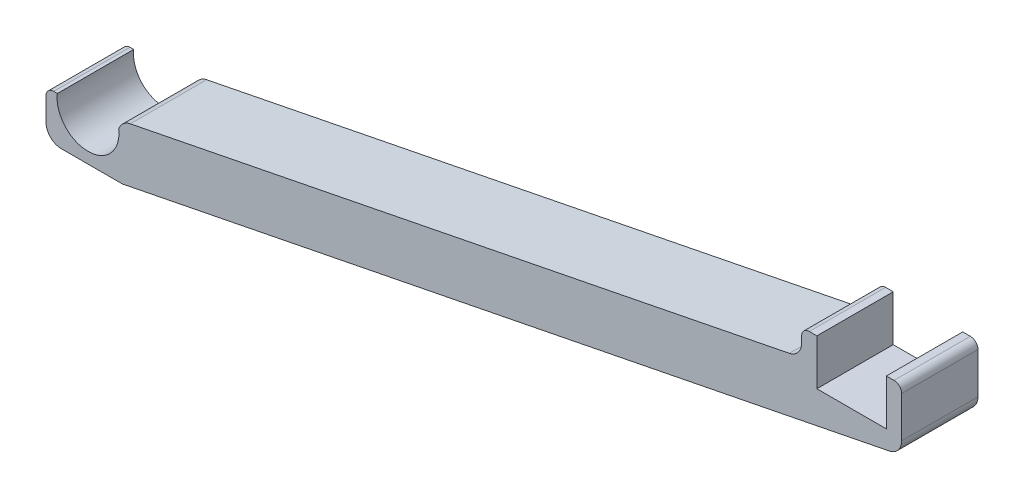
ISO-10303-21;
HEADER;
FILE_DESCRIPTION(('STEP AP214'),'2;1');
FILE_NAME('part.step','',(''),(''),'','','');
FILE_SCHEMA(('AUTOMOTIVE_DESIGN { 1 0 10303 214 1 1 1 1 }'));
ENDSEC;
DATA;
#1=APPLICATION_CONTEXT('core data for automotive mechanical design processes');
#2=APPLICATION_PROTOCOL_DEFINITION('international standard','automotive_design',2000,#1);
#3=PRODUCT_CONTEXT('',#1,'mechanical');
#4=PRODUCT('Part','Part','',(#3));
#5=PRODUCT_RELATED_PRODUCT_CATEGORY('part','',(#4));
#6=PRODUCT_DEFINITION_FORMATION('','',#4);
#7=PRODUCT_DEFINITION_CONTEXT('part definition',#1,'design');
#8=PRODUCT_DEFINITION('design','',#6,#7);
#9=PRODUCT_DEFINITION_SHAPE('','',#8);
#10=(LENGTH_UNIT() NAMED_UNIT(*) SI_UNIT(.MILLI.,.METRE.));
#11=(NAMED_UNIT(*) PLANE_ANGLE_UNIT() SI_UNIT($,.RADIAN.));
#12=(NAMED_UNIT(*) SI_UNIT($,.STERADIAN.) SOLID_ANGLE_UNIT());
#13=UNCERTAINTY_MEASURE_WITH_UNIT(LENGTH_MEASURE(1.E-05),#10,'distance_accuracy_value','');
#14=(GEOMETRIC_REPRESENTATION_CONTEXT(3) GLOBAL_UNCERTAINTY_ASSIGNED_CONTEXT((#13)) GLOBAL_UNIT_ASSIGNED_CONTEXT((#10,
#11,#12)) REPRESENTATION_CONTEXT('',''));
#15=CARTESIAN_POINT('',(0.,0.,0.));
#16=DIRECTION('',(0.,0.,1.));
#17=DIRECTION('',(1.,0.,0.));
#18=AXIS2_PLACEMENT_3D('',#15,#16,#17);
#19=CARTESIAN_POINT('',(0.,0.,10.));
#20=DIRECTION('',(0.,0.,-1.));
#21=DIRECTION('',(-1.,0.,0.));
#22=AXIS2_PLACEMENT_3D('',#19,#20,#21);
#23=CYLINDRICAL_SURFACE('',#22,4.05);
#24=CARTESIAN_POINT('',(0.,0.,0.));
#25=DIRECTION('',(0.,0.,-1.));
#26=DIRECTION('',(1.,0.,0.));
#27=AXIS2_PLACEMENT_3D('',#24,#25,#26);
#28=CIRCLE('',#27,4.05);
#29=CARTESIAN_POINT('',(4.01901729282172,0.500000000000001,0.));
#30=VERTEX_POINT('',#29);
#31=CARTESIAN_POINT('',(-4.01901729282172,0.5,0.));
#32=VERTEX_POINT('',#31);
#33=EDGE_CURVE('E215',#30,#32,#28,.T.);
#34=ORIENTED_EDGE('',*,*,#33,.T.);
#35=DIRECTION('',(0.,0.,-1.));
#36=VECTOR('',#35,1.);
#37=CARTESIAN_POINT('',(-4.01901729282172,0.5,10.));
#38=LINE('',#37,#36);
#39=CARTESIAN_POINT('',(-4.01901729282172,0.5,10.));
#40=VERTEX_POINT('',#39);
#41=EDGE_CURVE('E195',#40,#32,#38,.T.);
#42=ORIENTED_EDGE('',*,*,#41,.F.);
#43=CARTESIAN_POINT('',(0.,0.,10.));
#44=DIRECTION('',(0.,0.,-1.));
#45=DIRECTION('',(1.,0.,0.));
#46=AXIS2_PLACEMENT_3D('',#43,#44,#45);
#47=CIRCLE('',#46,4.05);
#48=CARTESIAN_POINT('',(4.01901729282172,0.500000000000001,10.));
#49=VERTEX_POINT('',#48);
#50=EDGE_CURVE('E202',#49,#40,#47,.T.);
#51=ORIENTED_EDGE('',*,*,#50,.F.);
#52=DIRECTION('',(0.,0.,-1.));
#53=VECTOR('',#52,1.);
#54=CARTESIAN_POINT('',(4.01901729282172,0.500000000000001,10.));
#55=LINE('',#54,#53);
#56=EDGE_CURVE('E370',#49,#30,#55,.T.);
#57=ORIENTED_EDGE('',*,*,#56,.T.);
#58=EDGE_LOOP('',(#34,#42,#51,#57));
#59=FACE_BOUND('',#58,.T.);
#60=ADVANCED_FACE('F39',(#59),#23,.F.);
#61=CARTESIAN_POINT('',(-4.01901729282172,0.5,10.));
#62=DIRECTION('',(0.,-1.,0.));
#63=DIRECTION('',(1.,0.,0.));
#64=AXIS2_PLACEMENT_3D('',#61,#62,#63);
#65=PLANE('',#64);
#66=DIRECTION('',(-1.,0.,0.));
#67=VECTOR('',#66,1.);
#68=CARTESIAN_POINT('',(-4.01901729282172,0.5,0.));
#69=LINE('',#68,#67);
#70=CARTESIAN_POINT('',(-4.5,0.5,0.));
#71=VERTEX_POINT('',#70);
#72=EDGE_CURVE('E416',#32,#71,#69,.T.);
#73=ORIENTED_EDGE('',*,*,#72,.T.);
#74=DIRECTION('',(0.,0.,-1.));
#75=VECTOR('',#74,1.);
#76=CARTESIAN_POINT('',(-4.5,0.5,10.));
#77=LINE('',#76,#75);
#78=CARTESIAN_POINT('',(-4.5,0.5,10.));
#79=VERTEX_POINT('',#78);
#80=EDGE_CURVE('E198',#71,#79,#77,.F.);
#81=ORIENTED_EDGE('',*,*,#80,.T.);
#82=DIRECTION('',(-1.,0.,0.));
#83=VECTOR('',#82,1.);
#84=CARTESIAN_POINT('',(-4.01901729282172,0.5,10.));
#85=LINE('',#84,#83);
#86=EDGE_CURVE('E190',#40,#79,#85,.T.);
#87=ORIENTED_EDGE('',*,*,#86,.F.);
#88=ORIENTED_EDGE('',*,*,#41,.T.);
#89=EDGE_LOOP('',(#73,#81,#87,#88));
#90=FACE_BOUND('',#89,.T.);
#91=ADVANCED_FACE('F193',(#90),#65,.F.);
#92=CARTESIAN_POINT('',(-5.5,0.499999999999999,10.));
#93=DIRECTION('',(1.,0.,0.));
#94=DIRECTION('',(0.,1.,0.));
#95=AXIS2_PLACEMENT_3D('',#92,#93,#94);
#96=PLANE('',#95);
#97=DIRECTION('',(0.,-1.,0.));
#98=VECTOR('',#97,1.);
#99=CARTESIAN_POINT('',(-5.5,0.499999999999999,10.));
#100=LINE('',#99,#98);
#101=CARTESIAN_POINT('',(-5.5,-0.500000000000001,10.));
#102=VERTEX_POINT('',#101);
#103=CARTESIAN_POINT('',(-5.5,-3.5,10.));
#104=VERTEX_POINT('',#103);
#105=EDGE_CURVE('E201',#102,#104,#100,.T.);
#106=ORIENTED_EDGE('',*,*,#105,.F.);
#107=DIRECTION('',(0.,0.,-1.));
#108=VECTOR('',#107,1.);
#109=CARTESIAN_POINT('',(-5.5,-0.500000000000001,10.));
#110=LINE('',#109,#108);
#111=CARTESIAN_POINT('',(-5.5,-0.500000000000001,0.));
#112=VERTEX_POINT('',#111);
#113=EDGE_CURVE('E294',#102,#112,#110,.T.);
#114=ORIENTED_EDGE('',*,*,#113,.T.);
#115=DIRECTION('',(0.,-1.,0.));
#116=VECTOR('',#115,1.);
#117=CARTESIAN_POINT('',(-5.5,0.499999999999999,0.));
#118=LINE('',#117,#116);
#119=CARTESIAN_POINT('',(-5.5,-3.5,0.));
#120=VERTEX_POINT('',#119);
#121=EDGE_CURVE('E419',#112,#120,#118,.T.);
#122=ORIENTED_EDGE('',*,*,#121,.T.);
#123=DIRECTION('',(0.,0.,-1.));
#124=VECTOR('',#123,1.);
#125=CARTESIAN_POINT('',(-5.5,-3.5,10.));
#126=LINE('',#125,#124);
#127=EDGE_CURVE('E268',#120,#104,#126,.F.);
#128=ORIENTED_EDGE('',*,*,#127,.T.);
#129=EDGE_LOOP('',(#106,#114,#122,#128));
#130=FACE_BOUND('',#129,.T.);
#131=ADVANCED_FACE('F471',(#130),#96,.F.);
#132=CARTESIAN_POINT('',(-5.5,-5.5,10.));
#133=DIRECTION('',(0.,1.,0.));
#134=DIRECTION('',(0.,0.,1.));
#135=AXIS2_PLACEMENT_3D('',#132,#133,#134);
#136=PLANE('',#135);
#137=DIRECTION('',(1.,0.,0.));
#138=VECTOR('',#137,1.);
#139=CARTESIAN_POINT('',(-5.5,-5.5,0.));
#140=LINE('',#139,#138);
#141=CARTESIAN_POINT('',(-3.5,-5.5,0.));
#142=VERTEX_POINT('',#141);
#143=CARTESIAN_POINT('',(4.30348365541933,-5.5,0.));
#144=VERTEX_POINT('',#143);
#145=EDGE_CURVE('E422',#142,#144,#140,.T.);
#146=ORIENTED_EDGE('',*,*,#145,.T.);
#147=DIRECTION('',(0.,0.,-1.));
#148=VECTOR('',#147,1.);
#149=CARTESIAN_POINT('',(4.30348365541933,-5.5,10.));
#150=LINE('',#149,#148);
#151=CARTESIAN_POINT('',(4.30348365541933,-5.5,10.));
#152=VERTEX_POINT('',#151);
#153=EDGE_CURVE('E265',#144,#152,#150,.F.);
#154=ORIENTED_EDGE('',*,*,#153,.T.);
#155=DIRECTION('',(1.,0.,0.));
#156=VECTOR('',#155,1.);
#157=CARTESIAN_POINT('',(-5.5,-5.5,10.));
#158=LINE('',#157,#156);
#159=CARTESIAN_POINT('',(-3.5,-5.5,10.));
#160=VERTEX_POINT('',#159);
#161=EDGE_CURVE('E451',#160,#152,#158,.T.);
#162=ORIENTED_EDGE('',*,*,#161,.F.);
#163=DIRECTION('',(0.,0.,-1.));
#164=VECTOR('',#163,1.);
#165=CARTESIAN_POINT('',(-3.5,-5.5,10.));
#166=LINE('',#165,#164);
#167=EDGE_CURVE('E261',#160,#142,#166,.T.);
#168=ORIENTED_EDGE('',*,*,#167,.T.);
#169=EDGE_LOOP('',(#146,#154,#162,#168));
#170=FACE_BOUND('',#169,.T.);
#171=ADVANCED_FACE('F534',(#170),#136,.F.);
#172=CARTESIAN_POINT('',(4.5,-5.5,10.));
#173=DIRECTION('',(-0.194637187076888,0.980875305738093,0.));
#174=DIRECTION('',(-0.980875305738093,-0.194637187076888,0.));
#175=AXIS2_PLACEMENT_3D('',#172,#173,#174);
#176=PLANE('',#175);
#177=DIRECTION('',(0.980875305738092,0.194637187076888,0.));
#178=VECTOR('',#177,1.);
#179=CARTESIAN_POINT('',(4.5,-5.5,0.));
#180=LINE('',#179,#178);
#181=CARTESIAN_POINT('',(4.6927580295731,-5.46175061147619,0.));
#182=VERTEX_POINT('',#181);
#183=CARTESIAN_POINT('',(104.939274374154,14.4303802653269,0.));
#184=VERTEX_POINT('',#183);
#185=EDGE_CURVE('E349',#182,#184,#180,.T.);
#186=ORIENTED_EDGE('',*,*,#185,.T.);
#187=DIRECTION('',(0.,0.,-1.));
#188=VECTOR('',#187,1.);
#189=CARTESIAN_POINT('',(104.939274374154,14.4303802653269,10.));
#190=LINE('',#189,#188);
#191=CARTESIAN_POINT('',(104.939274374154,14.4303802653269,10.));
#192=VERTEX_POINT('',#191);
#193=EDGE_CURVE('E246',#184,#192,#190,.F.);
#194=ORIENTED_EDGE('',*,*,#193,.T.);
#195=DIRECTION('',(0.980875305738092,0.194637187076888,0.));
#196=VECTOR('',#195,1.);
#197=CARTESIAN_POINT('',(4.5,-5.5,10.));
#198=LINE('',#197,#196);
#199=CARTESIAN_POINT('',(4.6927580295731,-5.46175061147619,10.));
#200=VERTEX_POINT('',#199);
#201=EDGE_CURVE('E441',#200,#192,#198,.T.);
#202=ORIENTED_EDGE('',*,*,#201,.F.);
#203=DIRECTION('',(0.,0.,-1.));
#204=VECTOR('',#203,1.);
#205=CARTESIAN_POINT('',(4.6927580295731,-5.46175061147619,10.));
#206=LINE('',#205,#204);
#207=EDGE_CURVE('E242',#200,#182,#206,.T.);
#208=ORIENTED_EDGE('',*,*,#207,.T.);
#209=EDGE_LOOP('',(#186,#194,#202,#208));
#210=FACE_BOUND('',#209,.T.);
#211=ADVANCED_FACE('F430',(#210),#176,.F.);
#212=CARTESIAN_POINT('',(106.55,14.75,10.));
#213=DIRECTION('',(-1.,0.,0.));
#214=DIRECTION('',(0.,-1.,0.));
#215=AXIS2_PLACEMENT_3D('',#212,#213,#214);
#216=PLANE('',#215);
#217=DIRECTION('',(0.,1.,0.));
#218=VECTOR('',#217,1.);
#219=CARTESIAN_POINT('',(106.55,14.75,0.));
#220=LINE('',#219,#218);
#221=CARTESIAN_POINT('',(106.55,16.3921308768031,0.));
#222=VERTEX_POINT('',#221);
#223=CARTESIAN_POINT('',(106.55,21.75,0.));
#224=VERTEX_POINT('',#223);
#225=EDGE_CURVE('E343',#222,#224,#220,.T.);
#226=ORIENTED_EDGE('',*,*,#225,.T.);
#227=DIRECTION('',(0.,0.,-1.));
#228=VECTOR('',#227,1.);
#229=CARTESIAN_POINT('',(106.55,21.75,10.));
#230=LINE('',#229,#228);
#231=CARTESIAN_POINT('',(106.55,21.75,10.));
#232=VERTEX_POINT('',#231);
#233=EDGE_CURVE('E11',#224,#232,#230,.F.);
#234=ORIENTED_EDGE('',*,*,#233,.T.);
#235=DIRECTION('',(0.,1.,0.));
#236=VECTOR('',#235,1.);
#237=CARTESIAN_POINT('',(106.55,14.75,10.));
#238=LINE('',#237,#236);
#239=CARTESIAN_POINT('',(106.55,16.3921308768031,10.));
#240=VERTEX_POINT('',#239);
#241=EDGE_CURVE('E440',#240,#232,#238,.T.);
#242=ORIENTED_EDGE('',*,*,#241,.F.);
#243=DIRECTION('',(0.,0.,-1.));
#244=VECTOR('',#243,1.);
#245=CARTESIAN_POINT('',(106.55,16.3921308768031,10.));
#246=LINE('',#245,#244);
#247=EDGE_CURVE('E217',#240,#222,#246,.T.);
#248=ORIENTED_EDGE('',*,*,#247,.T.);
#249=EDGE_LOOP('',(#226,#234,#242,#248));
#250=FACE_BOUND('',#249,.T.);
#251=ADVANCED_FACE('F443',(#250),#216,.F.);
#252=CARTESIAN_POINT('',(104.55,22.75,10.));
#253=DIRECTION('',(0.,-1.,0.));
#254=DIRECTION('',(1.,0.,0.));
#255=AXIS2_PLACEMENT_3D('',#252,#253,#254);
#256=PLANE('',#255);
#257=DIRECTION('',(-1.,0.,0.));
#258=VECTOR('',#257,1.);
#259=CARTESIAN_POINT('',(104.55,22.75,10.));
#260=LINE('',#259,#258);
#261=CARTESIAN_POINT('',(105.55,22.75,10.));
#262=VERTEX_POINT('',#261);
#263=CARTESIAN_POINT('',(104.55,22.75,10.));
#264=VERTEX_POINT('',#263);
#265=EDGE_CURVE('E331',#262,#264,#260,.T.);
#266=ORIENTED_EDGE('',*,*,#265,.F.);
#267=DIRECTION('',(0.,0.,-1.));
#268=VECTOR('',#267,1.);
#269=CARTESIAN_POINT('',(105.55,22.75,10.));
#270=LINE('',#269,#268);
#271=CARTESIAN_POINT('',(105.55,22.75,0.));
#272=VERTEX_POINT('',#271);
#273=EDGE_CURVE('E48',#262,#272,#270,.T.);
#274=ORIENTED_EDGE('',*,*,#273,.T.);
#275=DIRECTION('',(-1.,0.,0.));
#276=VECTOR('',#275,1.);
#277=CARTESIAN_POINT('',(104.55,22.75,0.));
#278=LINE('',#277,#276);
#279=CARTESIAN_POINT('',(104.55,22.75,0.));
#280=VERTEX_POINT('',#279);
#281=EDGE_CURVE('E330',#272,#280,#278,.T.);
#282=ORIENTED_EDGE('',*,*,#281,.T.);
#283=DIRECTION('',(0.,0.,-1.));
#284=VECTOR('',#283,1.);
#285=CARTESIAN_POINT('',(104.55,22.75,10.));
#286=LINE('',#285,#284);
#287=EDGE_CURVE('E218',#264,#280,#286,.T.);
#288=ORIENTED_EDGE('',*,*,#287,.F.);
#289=EDGE_LOOP('',(#266,#274,#282,#288));
#290=FACE_BOUND('',#289,.T.);
#291=ADVANCED_FACE('F328',(#290),#256,.F.);
#292=CARTESIAN_POINT('',(104.55,16.75,10.));
#293=DIRECTION('',(1.,0.,0.));
#294=DIRECTION('',(0.,1.,0.));
#295=AXIS2_PLACEMENT_3D('',#292,#293,#294);
#296=PLANE('',#295);
#297=DIRECTION('',(0.,-1.,0.));
#298=VECTOR('',#297,1.);
#299=CARTESIAN_POINT('',(104.55,16.75,0.));
#300=LINE('',#299,#298);
#301=CARTESIAN_POINT('',(104.55,16.75,0.));
#302=VERTEX_POINT('',#301);
#303=EDGE_CURVE('E341',#280,#302,#300,.T.);
#304=ORIENTED_EDGE('',*,*,#303,.T.);
#305=DIRECTION('',(0.,0.,-1.));
#306=VECTOR('',#305,1.);
#307=CARTESIAN_POINT('',(104.55,16.75,10.));
#308=LINE('',#307,#306);
#309=CARTESIAN_POINT('',(104.55,16.75,10.));
#310=VERTEX_POINT('',#309);
#311=EDGE_CURVE('E226',#310,#302,#308,.T.);
#312=ORIENTED_EDGE('',*,*,#311,.F.);
#313=DIRECTION('',(0.,-1.,0.));
#314=VECTOR('',#313,1.);
#315=CARTESIAN_POINT('',(104.55,16.75,10.));
#316=LINE('',#315,#314);
#317=EDGE_CURVE('E449',#264,#310,#316,.T.);
#318=ORIENTED_EDGE('',*,*,#317,.F.);
#319=ORIENTED_EDGE('',*,*,#287,.T.);
#320=EDGE_LOOP('',(#304,#312,#318,#319));
#321=FACE_BOUND('',#320,.T.);
#322=ADVANCED_FACE('F457',(#321),#296,.F.);
#323=CARTESIAN_POINT('',(95.45,16.75,10.));
#324=DIRECTION('',(0.,-1.,0.));
#325=DIRECTION('',(0.,0.,-1.));
#326=AXIS2_PLACEMENT_3D('',#323,#324,#325);
#327=PLANE('',#326);
#328=DIRECTION('',(-1.,0.,0.));
#329=VECTOR('',#328,1.);
#330=CARTESIAN_POINT('',(95.45,16.75,0.));
#331=LINE('',#330,#329);
#332=CARTESIAN_POINT('',(95.45,16.75,0.));
#333=VERTEX_POINT('',#332);
#334=EDGE_CURVE('E347',#302,#333,#331,.T.);
#335=ORIENTED_EDGE('',*,*,#334,.T.);
#336=DIRECTION('',(0.,0.,-1.));
#337=VECTOR('',#336,1.);
#338=CARTESIAN_POINT('',(95.45,16.75,10.));
#339=LINE('',#338,#337);
#340=CARTESIAN_POINT('',(95.45,16.75,10.));
#341=VERTEX_POINT('',#340);
#342=EDGE_CURVE('E377',#341,#333,#339,.T.);
#343=ORIENTED_EDGE('',*,*,#342,.F.);
#344=DIRECTION('',(-1.,0.,0.));
#345=VECTOR('',#344,1.);
#346=CARTESIAN_POINT('',(95.45,16.75,10.));
#347=LINE('',#346,#345);
#348=EDGE_CURVE('E387',#310,#341,#347,.T.);
#349=ORIENTED_EDGE('',*,*,#348,.F.);
#350=ORIENTED_EDGE('',*,*,#311,.T.);
#351=EDGE_LOOP('',(#335,#343,#349,#350));
#352=FACE_BOUND('',#351,.T.);
#353=ADVANCED_FACE('F385',(#352),#327,.F.);
#354=CARTESIAN_POINT('',(95.45,22.75,10.));
#355=DIRECTION('',(-1.,0.,0.));
#356=DIRECTION('',(0.,-1.,0.));
#357=AXIS2_PLACEMENT_3D('',#354,#355,#356);
#358=PLANE('',#357);
#359=DIRECTION('',(0.,1.,0.));
#360=VECTOR('',#359,1.);
#361=CARTESIAN_POINT('',(95.45,22.75,0.));
#362=LINE('',#361,#360);
#363=CARTESIAN_POINT('',(95.45,22.75,0.));
#364=VERTEX_POINT('',#363);
#365=EDGE_CURVE('E355',#333,#364,#362,.T.);
#366=ORIENTED_EDGE('',*,*,#365,.T.);
#367=DIRECTION('',(0.,0.,-1.));
#368=VECTOR('',#367,1.);
#369=CARTESIAN_POINT('',(95.45,22.75,10.));
#370=LINE('',#369,#368);
#371=CARTESIAN_POINT('',(95.45,22.75,10.));
#372=VERTEX_POINT('',#371);
#373=EDGE_CURVE('E373',#372,#364,#370,.T.);
#374=ORIENTED_EDGE('',*,*,#373,.F.);
#375=DIRECTION('',(0.,1.,0.));
#376=VECTOR('',#375,1.);
#377=CARTESIAN_POINT('',(95.45,22.75,10.));
#378=LINE('',#377,#376);
#379=EDGE_CURVE('E400',#341,#372,#378,.T.);
#380=ORIENTED_EDGE('',*,*,#379,.F.);
#381=ORIENTED_EDGE('',*,*,#342,.T.);
#382=EDGE_LOOP('',(#366,#374,#380,#381));
#383=FACE_BOUND('',#382,.T.);
#384=ADVANCED_FACE('F394',(#383),#358,.F.);
#385=CARTESIAN_POINT('',(93.45,22.75,10.));
#386=DIRECTION('',(0.,-1.,0.));
#387=DIRECTION('',(1.,0.,0.));
#388=AXIS2_PLACEMENT_3D('',#385,#386,#387);
#389=PLANE('',#388);
#390=DIRECTION('',(-1.,0.,0.));
#391=VECTOR('',#390,1.);
#392=CARTESIAN_POINT('',(93.45,22.75,0.));
#393=LINE('',#392,#391);
#394=CARTESIAN_POINT('',(94.45,22.75,0.));
#395=VERTEX_POINT('',#394);
#396=EDGE_CURVE('E358',#364,#395,#393,.T.);
#397=ORIENTED_EDGE('',*,*,#396,.T.);
#398=DIRECTION('',(0.,0.,-1.));
#399=VECTOR('',#398,1.);
#400=CARTESIAN_POINT('',(94.45,22.75,10.));
#401=LINE('',#400,#399);
#402=CARTESIAN_POINT('',(94.45,22.75,10.));
#403=VERTEX_POINT('',#402);
#404=EDGE_CURVE('E63',#395,#403,#401,.F.);
#405=ORIENTED_EDGE('',*,*,#404,.T.);
#406=DIRECTION('',(-1.,0.,0.));
#407=VECTOR('',#406,1.);
#408=CARTESIAN_POINT('',(93.45,22.75,10.));
#409=LINE('',#408,#407);
#410=EDGE_CURVE('E397',#372,#403,#409,.T.);
#411=ORIENTED_EDGE('',*,*,#410,.F.);
#412=ORIENTED_EDGE('',*,*,#373,.T.);
#413=EDGE_LOOP('',(#397,#405,#411,#412));
#414=FACE_BOUND('',#413,.T.);
#415=ADVANCED_FACE('F396',(#414),#389,.F.);
#416=CARTESIAN_POINT('',(93.45,19.2870220080564,10.));
#417=DIRECTION('',(1.,0.,0.));
#418=DIRECTION('',(0.,1.,0.));
#419=AXIS2_PLACEMENT_3D('',#416,#417,#418);
#420=PLANE('',#419);
#421=DIRECTION('',(0.,-1.,0.));
#422=VECTOR('',#421,1.);
#423=CARTESIAN_POINT('',(93.45,19.2870220080564,10.));
#424=LINE('',#423,#422);
#425=CARTESIAN_POINT('',(93.45,21.75,10.));
#426=VERTEX_POINT('',#425);
#427=CARTESIAN_POINT('',(93.45,20.9291528848595,10.));
#428=VERTEX_POINT('',#427);
#429=EDGE_CURVE('E399',#426,#428,#424,.T.);
#430=ORIENTED_EDGE('',*,*,#429,.F.);
#431=DIRECTION('',(0.,0.,-1.));
#432=VECTOR('',#431,1.);
#433=CARTESIAN_POINT('',(93.45,21.75,10.));
#434=LINE('',#433,#432);
#435=CARTESIAN_POINT('',(93.45,21.75,0.));
#436=VERTEX_POINT('',#435);
#437=EDGE_CURVE('E317',#426,#436,#434,.T.);
#438=ORIENTED_EDGE('',*,*,#437,.T.);
#439=DIRECTION('',(0.,-1.,0.));
#440=VECTOR('',#439,1.);
#441=CARTESIAN_POINT('',(93.45,19.2870220080564,0.));
#442=LINE('',#441,#440);
#443=CARTESIAN_POINT('',(93.45,20.9291528848595,0.));
#444=VERTEX_POINT('',#443);
#445=EDGE_CURVE('E361',#436,#444,#442,.T.);
#446=ORIENTED_EDGE('',*,*,#445,.T.);
#447=DIRECTION('',(0.,0.,-1.));
#448=VECTOR('',#447,1.);
#449=CARTESIAN_POINT('',(93.45,20.9291528848595,10.));
#450=LINE('',#449,#448);
#451=EDGE_CURVE('E283',#444,#428,#450,.F.);
#452=ORIENTED_EDGE('',*,*,#451,.T.);
#453=EDGE_LOOP('',(#430,#438,#446,#452));
#454=FACE_BOUND('',#453,.T.);
#455=ADVANCED_FACE('F505',(#454),#420,.F.);
#456=CARTESIAN_POINT('',(4.49350646304218,1.63519453012013,10.));
#457=DIRECTION('',(0.194637187076887,-0.980875305738093,0.));
#458=DIRECTION('',(0.980875305738093,0.194637187076887,0.));
#459=AXIS2_PLACEMENT_3D('',#456,#457,#458);
#460=PLANE('',#459);
#461=DIRECTION('',(-0.980875305738093,-0.194637187076888,0.));
#462=VECTOR('',#461,1.);
#463=CARTESIAN_POINT('',(4.49350646304218,1.63519453012013,0.));
#464=LINE('',#463,#462);
#465=CARTESIAN_POINT('',(91.8392743741538,18.9674022733833,0.));
#466=VERTEX_POINT('',#465);
#467=CARTESIAN_POINT('',(5.53861975479628,1.8425785983026,0.));
#468=VERTEX_POINT('',#467);
#469=EDGE_CURVE('E364',#466,#468,#464,.T.);
#470=ORIENTED_EDGE('',*,*,#469,.T.);
#471=DIRECTION('',(0.,0.,-1.));
#472=VECTOR('',#471,1.);
#473=CARTESIAN_POINT('',(5.53861975479628,1.8425785983026,10.));
#474=LINE('',#473,#472);
#475=CARTESIAN_POINT('',(5.53861975479628,1.8425785983026,10.));
#476=VERTEX_POINT('',#475);
#477=EDGE_CURVE('E280',#468,#476,#474,.F.);
#478=ORIENTED_EDGE('',*,*,#477,.T.);
#479=DIRECTION('',(-0.980875305738093,-0.194637187076888,0.));
#480=VECTOR('',#479,1.);
#481=CARTESIAN_POINT('',(4.49350646304218,1.63519453012013,10.));
#482=LINE('',#481,#480);
#483=CARTESIAN_POINT('',(91.8392743741538,18.9674022733833,10.));
#484=VERTEX_POINT('',#483);
#485=EDGE_CURVE('E404',#484,#476,#482,.T.);
#486=ORIENTED_EDGE('',*,*,#485,.F.);
#487=DIRECTION('',(0.,0.,-1.));
#488=VECTOR('',#487,1.);
#489=CARTESIAN_POINT('',(91.8392743741538,18.9674022733833,0.));
#490=LINE('',#489,#488);
#491=EDGE_CURVE('E276',#484,#466,#490,.T.);
#492=ORIENTED_EDGE('',*,*,#491,.T.);
#493=EDGE_LOOP('',(#470,#478,#486,#492));
#494=FACE_BOUND('',#493,.T.);
#495=ADVANCED_FACE('F513',(#494),#460,.F.);
#496=CARTESIAN_POINT('',(4.01901729282172,0.500000000000001,10.));
#497=DIRECTION('',(0.922645979304401,-0.385648022001181,0.));
#498=DIRECTION('',(0.385648022001181,0.922645979304401,0.));
#499=AXIS2_PLACEMENT_3D('',#496,#497,#498);
#500=PLANE('',#499);
#501=DIRECTION('',(-0.385648022001181,-0.922645979304401,0.));
#502=VECTOR('',#501,1.);
#503=CARTESIAN_POINT('',(4.01901729282172,0.500000000000001,10.));
#504=LINE('',#503,#502);
#505=CARTESIAN_POINT('',(4.08260217034125,0.652124030828772,10.));
#506=VERTEX_POINT('',#505);
#507=EDGE_CURVE('E207',#506,#49,#504,.T.);
#508=ORIENTED_EDGE('',*,*,#507,.F.);
#509=DIRECTION('',(0.,0.,-1.));
#510=VECTOR('',#509,1.);
#511=CARTESIAN_POINT('',(4.08260217034125,0.652124030828772,10.));
#512=LINE('',#511,#510);
#513=CARTESIAN_POINT('',(4.08260217034125,0.652124030828772,0.));
#514=VERTEX_POINT('',#513);
#515=EDGE_CURVE('E272',#506,#514,#512,.T.);
#516=ORIENTED_EDGE('',*,*,#515,.T.);
#517=DIRECTION('',(-0.385648022001181,-0.922645979304401,0.));
#518=VECTOR('',#517,1.);
#519=CARTESIAN_POINT('',(4.01901729282172,0.500000000000001,0.));
#520=LINE('',#519,#518);
#521=EDGE_CURVE('E212',#514,#30,#520,.T.);
#522=ORIENTED_EDGE('',*,*,#521,.T.);
#523=ORIENTED_EDGE('',*,*,#56,.F.);
#524=EDGE_LOOP('',(#508,#516,#522,#523));
#525=FACE_BOUND('',#524,.T.);
#526=ADVANCED_FACE('F517',(#525),#500,.F.);
#527=CARTESIAN_POINT('',(0.,0.,10.));
#528=DIRECTION('',(0.,0.,1.));
#529=DIRECTION('',(1.,0.,0.));
#530=AXIS2_PLACEMENT_3D('',#527,#528,#529);
#531=PLANE('',#530);
#532=ORIENTED_EDGE('',*,*,#86,.T.);
#533=CARTESIAN_POINT('',(-4.5,-0.5,10.));
#534=DIRECTION('',(0.,0.,1.));
#535=DIRECTION('',(1.,0.,0.));
#536=AXIS2_PLACEMENT_3D('',#533,#534,#535);
#537=CIRCLE('',#536,1.);
#538=EDGE_CURVE('E314',#79,#102,#537,.T.);
#539=ORIENTED_EDGE('',*,*,#538,.T.);
#540=ORIENTED_EDGE('',*,*,#105,.T.);
#541=CARTESIAN_POINT('',(-3.5,-3.5,10.));
#542=DIRECTION('',(0.,0.,1.));
#543=DIRECTION('',(1.,0.,0.));
#544=AXIS2_PLACEMENT_3D('',#541,#542,#543);
#545=CIRCLE('',#544,2.);
#546=EDGE_CURVE('E252',#104,#160,#545,.T.);
#547=ORIENTED_EDGE('',*,*,#546,.T.);
#548=ORIENTED_EDGE('',*,*,#161,.T.);
#549=CARTESIAN_POINT('',(4.30348365541933,-3.5,10.));
#550=DIRECTION('',(0.,0.,1.));
#551=DIRECTION('',(1.,0.,0.));
#552=AXIS2_PLACEMENT_3D('',#549,#550,#551);
#553=CIRCLE('',#552,2.);
#554=EDGE_CURVE('E255',#152,#200,#553,.T.);
#555=ORIENTED_EDGE('',*,*,#554,.T.);
#556=ORIENTED_EDGE('',*,*,#201,.T.);
#557=CARTESIAN_POINT('',(104.55,16.3921308768031,10.));
#558=DIRECTION('',(0.,0.,1.));
#559=DIRECTION('',(1.,0.,0.));
#560=AXIS2_PLACEMENT_3D('',#557,#558,#559);
#561=CIRCLE('',#560,2.);
#562=EDGE_CURVE('E258',#192,#240,#561,.T.);
#563=ORIENTED_EDGE('',*,*,#562,.T.);
#564=ORIENTED_EDGE('',*,*,#241,.T.);
#565=CARTESIAN_POINT('',(105.55,21.75,10.));
#566=DIRECTION('',(0.,0.,1.));
#567=DIRECTION('',(1.,0.,0.));
#568=AXIS2_PLACEMENT_3D('',#565,#566,#567);
#569=CIRCLE('',#568,1.);
#570=EDGE_CURVE('E309',#232,#262,#569,.T.);
#571=ORIENTED_EDGE('',*,*,#570,.T.);
#572=ORIENTED_EDGE('',*,*,#265,.T.);
#573=ORIENTED_EDGE('',*,*,#317,.T.);
#574=ORIENTED_EDGE('',*,*,#348,.T.);
#575=ORIENTED_EDGE('',*,*,#379,.T.);
#576=ORIENTED_EDGE('',*,*,#410,.T.);
#577=CARTESIAN_POINT('',(94.45,21.75,10.));
#578=DIRECTION('',(0.,0.,1.));
#579=DIRECTION('',(1.,0.,0.));
#580=AXIS2_PLACEMENT_3D('',#577,#578,#579);
#581=CIRCLE('',#580,1.);
#582=EDGE_CURVE('E55',#403,#426,#581,.T.);
#583=ORIENTED_EDGE('',*,*,#582,.T.);
#584=ORIENTED_EDGE('',*,*,#429,.T.);
#585=CARTESIAN_POINT('',(91.45,20.9291528848595,10.));
#586=DIRECTION('',(0.,0.,1.));
#587=DIRECTION('',(1.,0.,0.));
#588=AXIS2_PLACEMENT_3D('',#585,#586,#587);
#589=CIRCLE('',#588,2.);
#590=EDGE_CURVE('E291',#428,#484,#589,.F.);
#591=ORIENTED_EDGE('',*,*,#590,.T.);
#592=ORIENTED_EDGE('',*,*,#485,.T.);
#593=CARTESIAN_POINT('',(5.92789412895005,-0.11917201317359,10.));
#594=DIRECTION('',(0.,0.,1.));
#595=DIRECTION('',(1.,0.,0.));
#596=AXIS2_PLACEMENT_3D('',#593,#594,#595);
#597=CIRCLE('',#596,2.);
#598=EDGE_CURVE('E249',#476,#506,#597,.T.);
#599=ORIENTED_EDGE('',*,*,#598,.T.);
#600=ORIENTED_EDGE('',*,*,#507,.T.);
#601=ORIENTED_EDGE('',*,*,#50,.T.);
#602=EDGE_LOOP('',(#532,#539,#540,#547,#548,#555,#556,#563,#564,#571,#572,#573,#574,#575,#576,
#583,#584,#591,#592,#599,#600,#601));
#603=FACE_BOUND('',#602,.T.);
#604=ADVANCED_FACE('F205',(#603),#531,.T.);
#605=CARTESIAN_POINT('',(0.,0.,0.));
#606=DIRECTION('',(0.,0.,1.));
#607=DIRECTION('',(1.,0.,0.));
#608=AXIS2_PLACEMENT_3D('',#605,#606,#607);
#609=PLANE('',#608);
#610=ORIENTED_EDGE('',*,*,#121,.F.);
#611=CARTESIAN_POINT('',(-4.5,-0.5,0.));
#612=DIRECTION('',(0.,0.,1.));
#613=DIRECTION('',(1.,0.,0.));
#614=AXIS2_PLACEMENT_3D('',#611,#612,#613);
#615=CIRCLE('',#614,1.);
#616=EDGE_CURVE('E304',#112,#71,#615,.F.);
#617=ORIENTED_EDGE('',*,*,#616,.T.);
#618=ORIENTED_EDGE('',*,*,#72,.F.);
#619=ORIENTED_EDGE('',*,*,#33,.F.);
#620=ORIENTED_EDGE('',*,*,#521,.F.);
#621=CARTESIAN_POINT('',(5.92789412895005,-0.11917201317359,0.));
#622=DIRECTION('',(0.,0.,1.));
#623=DIRECTION('',(1.,0.,0.));
#624=AXIS2_PLACEMENT_3D('',#621,#622,#623);
#625=CIRCLE('',#624,2.);
#626=EDGE_CURVE('E223',#514,#468,#625,.F.);
#627=ORIENTED_EDGE('',*,*,#626,.T.);
#628=ORIENTED_EDGE('',*,*,#469,.F.);
#629=CARTESIAN_POINT('',(91.45,20.9291528848595,0.));
#630=DIRECTION('',(0.,0.,1.));
#631=DIRECTION('',(1.,0.,0.));
#632=AXIS2_PLACEMENT_3D('',#629,#630,#631);
#633=CIRCLE('',#632,2.);
#634=EDGE_CURVE('E287',#466,#444,#633,.T.);
#635=ORIENTED_EDGE('',*,*,#634,.T.);
#636=ORIENTED_EDGE('',*,*,#445,.F.);
#637=CARTESIAN_POINT('',(94.45,21.75,0.));
#638=DIRECTION('',(0.,0.,1.));
#639=DIRECTION('',(1.,0.,0.));
#640=AXIS2_PLACEMENT_3D('',#637,#638,#639);
#641=CIRCLE('',#640,1.);
#642=EDGE_CURVE('E301',#436,#395,#641,.F.);
#643=ORIENTED_EDGE('',*,*,#642,.T.);
#644=ORIENTED_EDGE('',*,*,#396,.F.);
#645=ORIENTED_EDGE('',*,*,#365,.F.);
#646=ORIENTED_EDGE('',*,*,#334,.F.);
#647=ORIENTED_EDGE('',*,*,#303,.F.);
#648=ORIENTED_EDGE('',*,*,#281,.F.);
#649=CARTESIAN_POINT('',(105.55,21.75,0.));
#650=DIRECTION('',(0.,0.,1.));
#651=DIRECTION('',(1.,0.,0.));
#652=AXIS2_PLACEMENT_3D('',#649,#650,#651);
#653=CIRCLE('',#652,1.);
#654=EDGE_CURVE('E298',#272,#224,#653,.F.);
#655=ORIENTED_EDGE('',*,*,#654,.T.);
#656=ORIENTED_EDGE('',*,*,#225,.F.);
#657=CARTESIAN_POINT('',(104.55,16.3921308768031,0.));
#658=DIRECTION('',(0.,0.,1.));
#659=DIRECTION('',(1.,0.,0.));
#660=AXIS2_PLACEMENT_3D('',#657,#658,#659);
#661=CIRCLE('',#660,2.);
#662=EDGE_CURVE('E239',#222,#184,#661,.F.);
#663=ORIENTED_EDGE('',*,*,#662,.T.);
#664=ORIENTED_EDGE('',*,*,#185,.F.);
#665=CARTESIAN_POINT('',(4.30348365541933,-3.5,0.));
#666=DIRECTION('',(0.,0.,1.));
#667=DIRECTION('',(1.,0.,0.));
#668=AXIS2_PLACEMENT_3D('',#665,#666,#667);
#669=CIRCLE('',#668,2.);
#670=EDGE_CURVE('E236',#182,#144,#669,.F.);
#671=ORIENTED_EDGE('',*,*,#670,.T.);
#672=ORIENTED_EDGE('',*,*,#145,.F.);
#673=CARTESIAN_POINT('',(-3.5,-3.5,0.));
#674=DIRECTION('',(0.,0.,1.));
#675=DIRECTION('',(1.,0.,0.));
#676=AXIS2_PLACEMENT_3D('',#673,#674,#675);
#677=CIRCLE('',#676,2.);
#678=EDGE_CURVE('E232',#142,#120,#677,.F.);
#679=ORIENTED_EDGE('',*,*,#678,.T.);
#680=EDGE_LOOP('',(#610,#617,#618,#619,#620,#627,#628,#635,#636,#643,#644,#645,#646,#647,#648,
#655,#656,#663,#664,#671,#672,#679));
#681=FACE_BOUND('',#680,.T.);
#682=ADVANCED_FACE('F337',(#681),#609,.F.);
#683=CARTESIAN_POINT('',(104.55,16.3921308768031,10.));
#684=DIRECTION('',(0.,0.,-1.));
#685=DIRECTION('',(-1.,0.,0.));
#686=AXIS2_PLACEMENT_3D('',#683,#684,#685);
#687=CYLINDRICAL_SURFACE('',#686,2.);
#688=ORIENTED_EDGE('',*,*,#562,.F.);
#689=ORIENTED_EDGE('',*,*,#193,.F.);
#690=ORIENTED_EDGE('',*,*,#662,.F.);
#691=ORIENTED_EDGE('',*,*,#247,.F.);
#692=EDGE_LOOP('',(#688,#689,#690,#691));
#693=FACE_BOUND('',#692,.T.);
#694=ADVANCED_FACE('F436',(#693),#687,.T.);
#695=CARTESIAN_POINT('',(4.30348365541933,-3.5,10.));
#696=DIRECTION('',(0.,0.,-1.));
#697=DIRECTION('',(-1.,0.,0.));
#698=AXIS2_PLACEMENT_3D('',#695,#696,#697);
#699=CYLINDRICAL_SURFACE('',#698,2.);
#700=ORIENTED_EDGE('',*,*,#554,.F.);
#701=ORIENTED_EDGE('',*,*,#153,.F.);
#702=ORIENTED_EDGE('',*,*,#670,.F.);
#703=ORIENTED_EDGE('',*,*,#207,.F.);
#704=EDGE_LOOP('',(#700,#701,#702,#703));
#705=FACE_BOUND('',#704,.T.);
#706=ADVANCED_FACE('F477',(#705),#699,.T.);
#707=CARTESIAN_POINT('',(-3.5,-3.5,10.));
#708=DIRECTION('',(0.,0.,-1.));
#709=DIRECTION('',(-1.,0.,0.));
#710=AXIS2_PLACEMENT_3D('',#707,#708,#709);
#711=CYLINDRICAL_SURFACE('',#710,2.);
#712=ORIENTED_EDGE('',*,*,#546,.F.);
#713=ORIENTED_EDGE('',*,*,#127,.F.);
#714=ORIENTED_EDGE('',*,*,#678,.F.);
#715=ORIENTED_EDGE('',*,*,#167,.F.);
#716=EDGE_LOOP('',(#712,#713,#714,#715));
#717=FACE_BOUND('',#716,.T.);
#718=ADVANCED_FACE('F480',(#717),#711,.T.);
#719=CARTESIAN_POINT('',(5.92789412895005,-0.11917201317359,10.));
#720=DIRECTION('',(0.,0.,-1.));
#721=DIRECTION('',(-1.,0.,0.));
#722=AXIS2_PLACEMENT_3D('',#719,#720,#721);
#723=CYLINDRICAL_SURFACE('',#722,2.);
#724=ORIENTED_EDGE('',*,*,#598,.F.);
#725=ORIENTED_EDGE('',*,*,#477,.F.);
#726=ORIENTED_EDGE('',*,*,#626,.F.);
#727=ORIENTED_EDGE('',*,*,#515,.F.);
#728=EDGE_LOOP('',(#724,#725,#726,#727));
#729=FACE_BOUND('',#728,.T.);
#730=ADVANCED_FACE('F484',(#729),#723,.T.);
#731=CARTESIAN_POINT('',(91.45,20.9291528848595,10.));
#732=DIRECTION('',(0.,0.,1.));
#733=DIRECTION('',(1.,0.,0.));
#734=AXIS2_PLACEMENT_3D('',#731,#732,#733);
#735=CYLINDRICAL_SURFACE('',#734,2.);
#736=ORIENTED_EDGE('',*,*,#590,.F.);
#737=ORIENTED_EDGE('',*,*,#451,.F.);
#738=ORIENTED_EDGE('',*,*,#634,.F.);
#739=ORIENTED_EDGE('',*,*,#491,.F.);
#740=EDGE_LOOP('',(#736,#737,#738,#739));
#741=FACE_BOUND('',#740,.T.);
#742=ADVANCED_FACE('F488',(#741),#735,.F.);
#743=CARTESIAN_POINT('',(-4.5,-0.5,10.));
#744=DIRECTION('',(0.,0.,-1.));
#745=DIRECTION('',(-1.,0.,0.));
#746=AXIS2_PLACEMENT_3D('',#743,#744,#745);
#747=CYLINDRICAL_SURFACE('',#746,1.);
#748=ORIENTED_EDGE('',*,*,#538,.F.);
#749=ORIENTED_EDGE('',*,*,#80,.F.);
#750=ORIENTED_EDGE('',*,*,#616,.F.);
#751=ORIENTED_EDGE('',*,*,#113,.F.);
#752=EDGE_LOOP('',(#748,#749,#750,#751));
#753=FACE_BOUND('',#752,.T.);
#754=ADVANCED_FACE('F492',(#753),#747,.T.);
#755=CARTESIAN_POINT('',(94.45,21.75,10.));
#756=DIRECTION('',(0.,0.,-1.));
#757=DIRECTION('',(-1.,0.,0.));
#758=AXIS2_PLACEMENT_3D('',#755,#756,#757);
#759=CYLINDRICAL_SURFACE('',#758,1.);
#760=ORIENTED_EDGE('',*,*,#582,.F.);
#761=ORIENTED_EDGE('',*,*,#404,.F.);
#762=ORIENTED_EDGE('',*,*,#642,.F.);
#763=ORIENTED_EDGE('',*,*,#437,.F.);
#764=EDGE_LOOP('',(#760,#761,#762,#763));
#765=FACE_BOUND('',#764,.T.);
#766=ADVANCED_FACE('F495',(#765),#759,.T.);
#767=CARTESIAN_POINT('',(105.55,21.75,10.));
#768=DIRECTION('',(0.,0.,-1.));
#769=DIRECTION('',(-1.,0.,0.));
#770=AXIS2_PLACEMENT_3D('',#767,#768,#769);
#771=CYLINDRICAL_SURFACE('',#770,1.);
#772=ORIENTED_EDGE('',*,*,#570,.F.);
#773=ORIENTED_EDGE('',*,*,#233,.F.);
#774=ORIENTED_EDGE('',*,*,#654,.F.);
#775=ORIENTED_EDGE('',*,*,#273,.F.);
#776=EDGE_LOOP('',(#772,#773,#774,#775));
#777=FACE_BOUND('',#776,.T.);
#778=ADVANCED_FACE('F41',(#777),#771,.T.);
#779=CLOSED_SHELL('',(#60,#91,#131,#171,#211,#251,#291,#322,#353,#384,#415,#455,#495,#526,#604,
#682,#694,#706,#718,#730,#742,#754,#766,#778));
#780=MANIFOLD_SOLID_BREP('B2',#779);
#781=ADVANCED_BREP_SHAPE_REPRESENTATION('',(#18,#780),#14);
#782=SHAPE_DEFINITION_REPRESENTATION(#9,#781);
ENDSEC;
END-ISO-10303-21;
